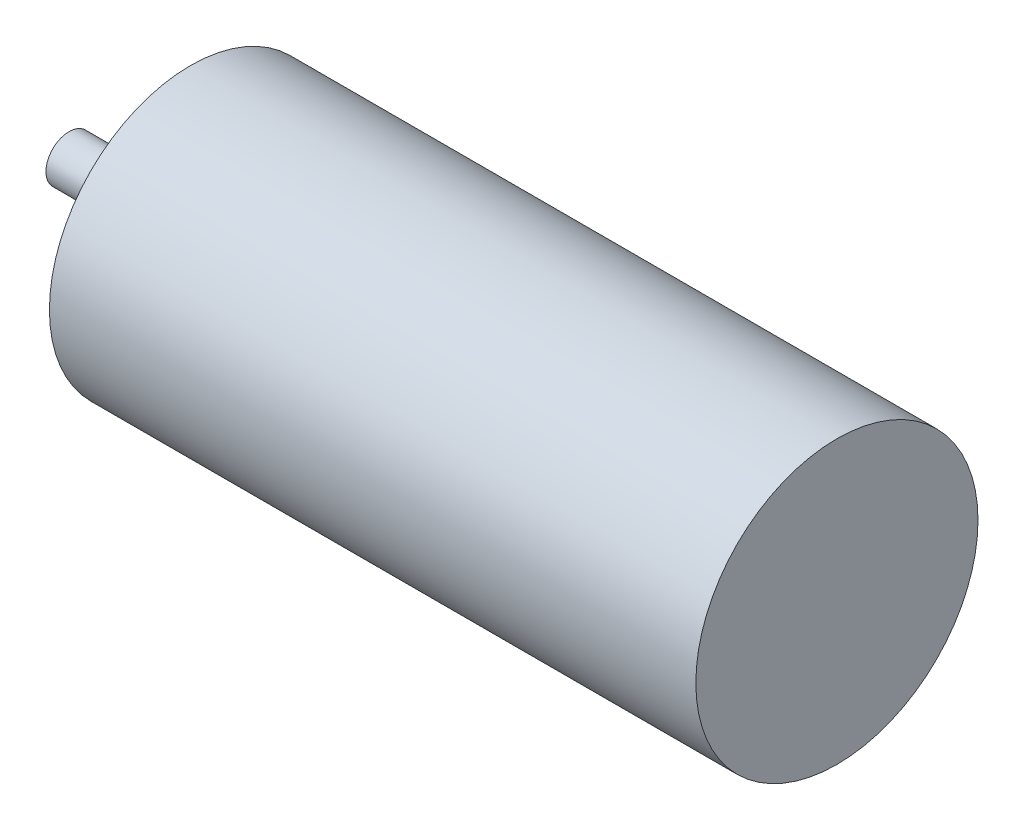
ISO-10303-21;
HEADER;
FILE_DESCRIPTION(('STEP AP214'),'2;1');
FILE_NAME('part.step','',(''),(''),'','','');
FILE_SCHEMA(('AUTOMOTIVE_DESIGN { 1 0 10303 214 1 1 1 1 }'));
ENDSEC;
DATA;
#1=APPLICATION_CONTEXT('core data for automotive mechanical design processes');
#2=APPLICATION_PROTOCOL_DEFINITION('international standard','automotive_design',2000,#1);
#3=PRODUCT_CONTEXT('',#1,'mechanical');
#4=PRODUCT('Part','Part','',(#3));
#5=PRODUCT_RELATED_PRODUCT_CATEGORY('part','',(#4));
#6=PRODUCT_DEFINITION_FORMATION('','',#4);
#7=PRODUCT_DEFINITION_CONTEXT('part definition',#1,'design');
#8=PRODUCT_DEFINITION('design','',#6,#7);
#9=PRODUCT_DEFINITION_SHAPE('','',#8);
#10=(LENGTH_UNIT() NAMED_UNIT(*) SI_UNIT(.MILLI.,.METRE.));
#11=(NAMED_UNIT(*) PLANE_ANGLE_UNIT() SI_UNIT($,.RADIAN.));
#12=(NAMED_UNIT(*) SI_UNIT($,.STERADIAN.) SOLID_ANGLE_UNIT());
#13=UNCERTAINTY_MEASURE_WITH_UNIT(LENGTH_MEASURE(1.E-05),#10,'distance_accuracy_value','');
#14=(GEOMETRIC_REPRESENTATION_CONTEXT(3) GLOBAL_UNCERTAINTY_ASSIGNED_CONTEXT((#13)) GLOBAL_UNIT_ASSIGNED_CONTEXT((#10,
#11,#12)) REPRESENTATION_CONTEXT('',''));
#15=CARTESIAN_POINT('',(0.,0.,0.));
#16=DIRECTION('',(0.,0.,1.));
#17=DIRECTION('',(1.,0.,0.));
#18=AXIS2_PLACEMENT_3D('',#15,#16,#17);
#19=CARTESIAN_POINT('',(-66.4,0.,0.));
#20=DIRECTION('',(1.,0.,0.));
#21=DIRECTION('',(0.,0.,-1.));
#22=AXIS2_PLACEMENT_3D('',#19,#20,#21);
#23=PLANE('',#22);
#24=CARTESIAN_POINT('',(-66.4,0.,0.));
#25=DIRECTION('',(1.,0.,0.));
#26=DIRECTION('',(0.,0.,-1.));
#27=AXIS2_PLACEMENT_3D('',#24,#25,#26);
#28=CIRCLE('',#27,1.99999999999999);
#29=CARTESIAN_POINT('',(-66.4,0.,-1.99999999999999));
#30=VERTEX_POINT('',#29);
#31=EDGE_CURVE('E52',#30,#30,#28,.T.);
#32=ORIENTED_EDGE('',*,*,#31,.F.);
#33=EDGE_LOOP('',(#32));
#34=FACE_BOUND('',#33,.T.);
#35=ADVANCED_FACE('F30',(#34),#23,.F.);
#36=CARTESIAN_POINT('',(0.,0.,0.));
#37=DIRECTION('',(1.,0.,0.));
#38=DIRECTION('',(0.,0.,-1.));
#39=AXIS2_PLACEMENT_3D('',#36,#37,#38);
#40=PLANE('',#39);
#41=CARTESIAN_POINT('',(0.,0.,0.));
#42=DIRECTION('',(1.,0.,0.));
#43=DIRECTION('',(0.,0.,-1.));
#44=AXIS2_PLACEMENT_3D('',#41,#42,#43);
#45=CIRCLE('',#44,12.2);
#46=CARTESIAN_POINT('',(0.,0.,-12.2));
#47=VERTEX_POINT('',#46);
#48=EDGE_CURVE('E10',#47,#47,#45,.T.);
#49=ORIENTED_EDGE('',*,*,#48,.T.);
#50=EDGE_LOOP('',(#49));
#51=FACE_BOUND('',#50,.T.);
#52=ADVANCED_FACE('F60',(#51),#40,.T.);
#53=CARTESIAN_POINT('',(0.,0.,0.));
#54=DIRECTION('',(1.,0.,0.));
#55=DIRECTION('',(0.,0.,-1.));
#56=AXIS2_PLACEMENT_3D('',#53,#54,#55);
#57=CYLINDRICAL_SURFACE('',#56,12.2);
#58=CARTESIAN_POINT('',(-55.9,0.,0.));
#59=DIRECTION('',(1.,0.,0.));
#60=DIRECTION('',(0.,0.,-1.));
#61=AXIS2_PLACEMENT_3D('',#58,#59,#60);
#62=CIRCLE('',#61,12.2);
#63=CARTESIAN_POINT('',(-55.9,0.,-12.2));
#64=VERTEX_POINT('',#63);
#65=EDGE_CURVE('E36',#64,#64,#62,.T.);
#66=ORIENTED_EDGE('',*,*,#65,.T.);
#67=EDGE_LOOP('',(#66));
#68=FACE_BOUND('',#67,.T.);
#69=ORIENTED_EDGE('',*,*,#48,.F.);
#70=EDGE_LOOP('',(#69));
#71=FACE_BOUND('',#70,.T.);
#72=ADVANCED_FACE('F64',(#68,#71),#57,.T.);
#73=CARTESIAN_POINT('',(-55.9,0.,0.));
#74=DIRECTION('',(1.,0.,0.));
#75=DIRECTION('',(0.,0.,-1.));
#76=AXIS2_PLACEMENT_3D('',#73,#74,#75);
#77=PLANE('',#76);
#78=ORIENTED_EDGE('',*,*,#65,.F.);
#79=EDGE_LOOP('',(#78));
#80=FACE_BOUND('',#79,.T.);
#81=CARTESIAN_POINT('',(-55.9,0.,0.));
#82=DIRECTION('',(1.,0.,0.));
#83=DIRECTION('',(0.,0.,-1.));
#84=AXIS2_PLACEMENT_3D('',#81,#82,#83);
#85=CIRCLE('',#84,3.49999999999999);
#86=CARTESIAN_POINT('',(-55.9,0.,-3.49999999999999));
#87=VERTEX_POINT('',#86);
#88=EDGE_CURVE('E40',#87,#87,#85,.T.);
#89=ORIENTED_EDGE('',*,*,#88,.T.);
#90=EDGE_LOOP('',(#89));
#91=FACE_BOUND('',#90,.T.);
#92=ADVANCED_FACE('F68',(#80,#91),#77,.F.);
#93=CARTESIAN_POINT('',(0.,0.,0.));
#94=DIRECTION('',(1.,0.,0.));
#95=DIRECTION('',(0.,0.,-1.));
#96=AXIS2_PLACEMENT_3D('',#93,#94,#95);
#97=CYLINDRICAL_SURFACE('',#96,3.49999999999999);
#98=CARTESIAN_POINT('',(-57.9,0.,0.));
#99=DIRECTION('',(1.,0.,0.));
#100=DIRECTION('',(0.,0.,-1.));
#101=AXIS2_PLACEMENT_3D('',#98,#99,#100);
#102=CIRCLE('',#101,3.49999999999999);
#103=CARTESIAN_POINT('',(-57.9,0.,-3.49999999999999));
#104=VERTEX_POINT('',#103);
#105=EDGE_CURVE('E44',#104,#104,#102,.T.);
#106=ORIENTED_EDGE('',*,*,#105,.T.);
#107=EDGE_LOOP('',(#106));
#108=FACE_BOUND('',#107,.T.);
#109=ORIENTED_EDGE('',*,*,#88,.F.);
#110=EDGE_LOOP('',(#109));
#111=FACE_BOUND('',#110,.T.);
#112=ADVANCED_FACE('F73',(#108,#111),#97,.T.);
#113=CARTESIAN_POINT('',(-57.9,0.,0.));
#114=DIRECTION('',(1.,0.,0.));
#115=DIRECTION('',(0.,0.,-1.));
#116=AXIS2_PLACEMENT_3D('',#113,#114,#115);
#117=PLANE('',#116);
#118=ORIENTED_EDGE('',*,*,#105,.F.);
#119=EDGE_LOOP('',(#118));
#120=FACE_BOUND('',#119,.T.);
#121=CARTESIAN_POINT('',(-57.9,0.,0.));
#122=DIRECTION('',(1.,0.,0.));
#123=DIRECTION('',(0.,0.,-1.));
#124=AXIS2_PLACEMENT_3D('',#121,#122,#123);
#125=CIRCLE('',#124,1.99999999999999);
#126=CARTESIAN_POINT('',(-57.9,0.,-1.99999999999999));
#127=VERTEX_POINT('',#126);
#128=EDGE_CURVE('E49',#127,#127,#125,.T.);
#129=ORIENTED_EDGE('',*,*,#128,.T.);
#130=EDGE_LOOP('',(#129));
#131=FACE_BOUND('',#130,.T.);
#132=ADVANCED_FACE('F77',(#120,#131),#117,.F.);
#133=CARTESIAN_POINT('',(0.,0.,0.));
#134=DIRECTION('',(1.,0.,0.));
#135=DIRECTION('',(0.,0.,-1.));
#136=AXIS2_PLACEMENT_3D('',#133,#134,#135);
#137=CYLINDRICAL_SURFACE('',#136,1.99999999999999);
#138=ORIENTED_EDGE('',*,*,#31,.T.);
#139=EDGE_LOOP('',(#138));
#140=FACE_BOUND('',#139,.T.);
#141=ORIENTED_EDGE('',*,*,#128,.F.);
#142=EDGE_LOOP('',(#141));
#143=FACE_BOUND('',#142,.T.);
#144=ADVANCED_FACE('F56',(#140,#143),#137,.T.);
#145=CLOSED_SHELL('',(#35,#52,#72,#92,#112,#132,#144));
#146=MANIFOLD_SOLID_BREP('B2',#145);
#147=ADVANCED_BREP_SHAPE_REPRESENTATION('',(#18,#146),#14);
#148=SHAPE_DEFINITION_REPRESENTATION(#9,#147);
ENDSEC;
END-ISO-10303-21;
